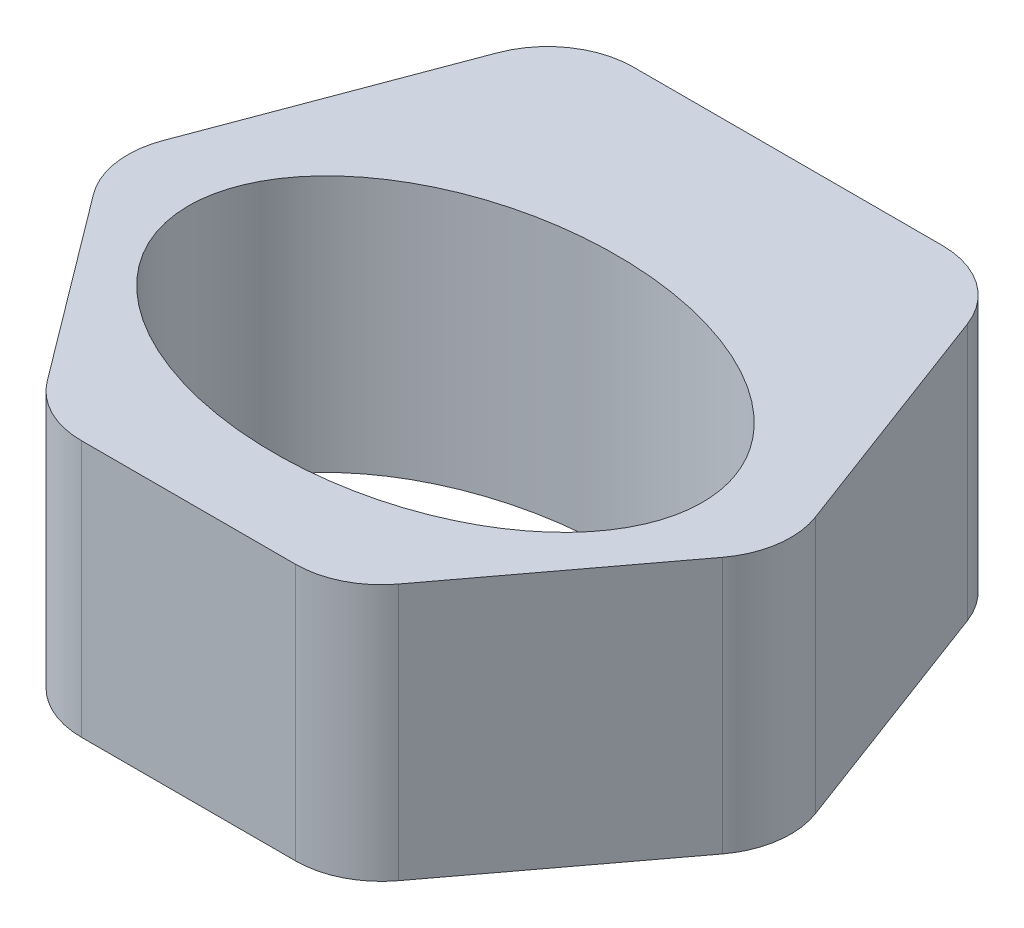
ISO-10303-21;
HEADER;
FILE_DESCRIPTION(('STEP AP214'),'2;1');
FILE_NAME('part.step','',(''),(''),'','','');
FILE_SCHEMA(('AUTOMOTIVE_DESIGN { 1 0 10303 214 1 1 1 1 }'));
ENDSEC;
DATA;
#1=APPLICATION_CONTEXT('core data for automotive mechanical design processes');
#2=APPLICATION_PROTOCOL_DEFINITION('international standard','automotive_design',2000,#1);
#3=PRODUCT_CONTEXT('',#1,'mechanical');
#4=PRODUCT('Part','Part','',(#3));
#5=PRODUCT_RELATED_PRODUCT_CATEGORY('part','',(#4));
#6=PRODUCT_DEFINITION_FORMATION('','',#4);
#7=PRODUCT_DEFINITION_CONTEXT('part definition',#1,'design');
#8=PRODUCT_DEFINITION('design','',#6,#7);
#9=PRODUCT_DEFINITION_SHAPE('','',#8);
#10=(LENGTH_UNIT() NAMED_UNIT(*) SI_UNIT(.MILLI.,.METRE.));
#11=(NAMED_UNIT(*) PLANE_ANGLE_UNIT() SI_UNIT($,.RADIAN.));
#12=(NAMED_UNIT(*) SI_UNIT($,.STERADIAN.) SOLID_ANGLE_UNIT());
#13=UNCERTAINTY_MEASURE_WITH_UNIT(LENGTH_MEASURE(1.E-05),#10,'distance_accuracy_value','');
#14=(GEOMETRIC_REPRESENTATION_CONTEXT(3) GLOBAL_UNCERTAINTY_ASSIGNED_CONTEXT((#13)) GLOBAL_UNIT_ASSIGNED_CONTEXT((#10,
#11,#12)) REPRESENTATION_CONTEXT('',''));
#15=CARTESIAN_POINT('',(0.,0.,0.));
#16=DIRECTION('',(0.,0.,1.));
#17=DIRECTION('',(1.,0.,0.));
#18=AXIS2_PLACEMENT_3D('',#15,#16,#17);
#19=CARTESIAN_POINT('',(0.,30.,0.));
#20=DIRECTION('',(0.,1.,0.));
#21=DIRECTION('',(0.,0.,1.));
#22=AXIS2_PLACEMENT_3D('',#19,#20,#21);
#23=PLANE('',#22);
#24=DIRECTION('',(-1.,0.,0.));
#25=VECTOR('',#24,1.);
#26=CARTESIAN_POINT('',(25.,30.,-40.));
#27=LINE('',#26,#25);
#28=CARTESIAN_POINT('',(18.0699953183531,30.,-40.));
#29=VERTEX_POINT('',#28);
#30=CARTESIAN_POINT('',(-18.0699953183531,30.,-40.));
#31=VERTEX_POINT('',#30);
#32=EDGE_CURVE('E164',#29,#31,#27,.T.);
#33=ORIENTED_EDGE('',*,*,#32,.T.);
#34=CARTESIAN_POINT('',(-18.0699953183531,30.,-30.));
#35=DIRECTION('',(0.,1.,0.));
#36=DIRECTION('',(0.,0.,1.));
#37=AXIS2_PLACEMENT_3D('',#34,#35,#36);
#38=CIRCLE('',#37,10.);
#39=CARTESIAN_POINT('',(-27.4332870940435,30.,-33.5112344158839));
#40=VERTEX_POINT('',#39);
#41=EDGE_CURVE('E196',#31,#40,#38,.T.);
#42=ORIENTED_EDGE('',*,*,#41,.T.);
#43=DIRECTION('',(-0.351123441588391,0.,0.936329177569045));
#44=VECTOR('',#43,1.);
#45=CARTESIAN_POINT('',(-25.,30.,-40.));
#46=LINE('',#45,#44);
#47=CARTESIAN_POINT('',(-38.0766219879258,30.,-5.12900803219777));
#48=VERTEX_POINT('',#47);
#49=EDGE_CURVE('E146',#40,#48,#46,.T.);
#50=ORIENTED_EDGE('',*,*,#49,.T.);
#51=CARTESIAN_POINT('',(-28.7133302122354,30.,-1.61777361631385));
#52=DIRECTION('',(0.,1.,0.));
#53=DIRECTION('',(0.,0.,1.));
#54=AXIS2_PLACEMENT_3D('',#51,#52,#53);
#55=CIRCLE('',#54,10.);
#56=CARTESIAN_POINT('',(-36.7133302122354,30.,4.38222638368614));
#57=VERTEX_POINT('',#56);
#58=EDGE_CURVE('E192',#48,#57,#55,.T.);
#59=ORIENTED_EDGE('',*,*,#58,.T.);
#60=DIRECTION('',(0.6,0.,0.8));
#61=VECTOR('',#60,1.);
#62=CARTESIAN_POINT('',(-40.,30.,0.));
#63=LINE('',#62,#61);
#64=CARTESIAN_POINT('',(-20.5,30.,26.));
#65=VERTEX_POINT('',#64);
#66=EDGE_CURVE('E238',#57,#65,#63,.T.);
#67=ORIENTED_EDGE('',*,*,#66,.T.);
#68=CARTESIAN_POINT('',(-12.5,30.,20.));
#69=DIRECTION('',(0.,1.,0.));
#70=DIRECTION('',(0.,0.,1.));
#71=AXIS2_PLACEMENT_3D('',#68,#69,#70);
#72=CIRCLE('',#71,10.);
#73=CARTESIAN_POINT('',(-12.5,30.,30.));
#74=VERTEX_POINT('',#73);
#75=EDGE_CURVE('E190',#65,#74,#72,.T.);
#76=ORIENTED_EDGE('',*,*,#75,.T.);
#77=DIRECTION('',(1.,0.,0.));
#78=VECTOR('',#77,1.);
#79=CARTESIAN_POINT('',(-17.5,30.,30.));
#80=LINE('',#79,#78);
#81=CARTESIAN_POINT('',(12.5,30.,30.));
#82=VERTEX_POINT('',#81);
#83=EDGE_CURVE('E224',#74,#82,#80,.T.);
#84=ORIENTED_EDGE('',*,*,#83,.T.);
#85=CARTESIAN_POINT('',(12.5,30.,20.));
#86=DIRECTION('',(0.,1.,0.));
#87=DIRECTION('',(0.,0.,1.));
#88=AXIS2_PLACEMENT_3D('',#85,#86,#87);
#89=CIRCLE('',#88,10.);
#90=CARTESIAN_POINT('',(20.5,30.,26.));
#91=VERTEX_POINT('',#90);
#92=EDGE_CURVE('E188',#82,#91,#89,.T.);
#93=ORIENTED_EDGE('',*,*,#92,.T.);
#94=DIRECTION('',(0.6,0.,-0.8));
#95=VECTOR('',#94,1.);
#96=CARTESIAN_POINT('',(40.,30.,0.));
#97=LINE('',#96,#95);
#98=CARTESIAN_POINT('',(36.7133302122354,30.,4.38222638368616));
#99=VERTEX_POINT('',#98);
#100=EDGE_CURVE('E215',#91,#99,#97,.T.);
#101=ORIENTED_EDGE('',*,*,#100,.T.);
#102=CARTESIAN_POINT('',(28.7133302122354,30.,-1.61777361631384));
#103=DIRECTION('',(0.,1.,0.));
#104=DIRECTION('',(0.,0.,1.));
#105=AXIS2_PLACEMENT_3D('',#102,#103,#104);
#106=CIRCLE('',#105,10.);
#107=CARTESIAN_POINT('',(38.0766219879258,30.,-5.12900803219775));
#108=VERTEX_POINT('',#107);
#109=EDGE_CURVE('E57',#99,#108,#106,.T.);
#110=ORIENTED_EDGE('',*,*,#109,.T.);
#111=DIRECTION('',(-0.351123441588391,0.,-0.936329177569045));
#112=VECTOR('',#111,1.);
#113=CARTESIAN_POINT('',(25.,30.,-40.));
#114=LINE('',#113,#112);
#115=CARTESIAN_POINT('',(27.4332870940435,30.,-33.5112344158839));
#116=VERTEX_POINT('',#115);
#117=EDGE_CURVE('E223',#108,#116,#114,.T.);
#118=ORIENTED_EDGE('',*,*,#117,.T.);
#119=CARTESIAN_POINT('',(18.0699953183531,30.,-30.));
#120=DIRECTION('',(0.,1.,0.));
#121=DIRECTION('',(0.,0.,1.));
#122=AXIS2_PLACEMENT_3D('',#119,#120,#121);
#123=CIRCLE('',#122,10.);
#124=EDGE_CURVE('E194',#116,#29,#123,.T.);
#125=ORIENTED_EDGE('',*,*,#124,.T.);
#126=EDGE_LOOP('',(#33,#42,#50,#59,#67,#76,#84,#93,#101,#110,#118,#125));
#127=FACE_BOUND('',#126,.T.);
#128=CARTESIAN_POINT('',(0.,30.,0.));
#129=DIRECTION('',(0.,1.,0.));
#130=DIRECTION('',(-1.,0.,0.));
#131=AXIS2_PLACEMENT_3D('',#128,#129,#130);
#132=ELLIPSE('',#131,30.,20.);
#133=CARTESIAN_POINT('',(-30.,30.,0.));
#134=VERTEX_POINT('',#133);
#135=EDGE_CURVE('E155',#134,#134,#132,.T.);
#136=ORIENTED_EDGE('',*,*,#135,.F.);
#137=EDGE_LOOP('',(#136));
#138=FACE_BOUND('',#137,.T.);
#139=ADVANCED_FACE('F35',(#127,#138),#23,.T.);
#140=CARTESIAN_POINT('',(0.,0.,0.));
#141=DIRECTION('',(0.,1.,0.));
#142=DIRECTION('',(0.,0.,1.));
#143=AXIS2_PLACEMENT_3D('',#140,#141,#142);
#144=PLANE('',#143);
#145=DIRECTION('',(-0.351123441588391,0.,0.936329177569045));
#146=VECTOR('',#145,1.);
#147=CARTESIAN_POINT('',(-25.,0.,-40.));
#148=LINE('',#147,#146);
#149=CARTESIAN_POINT('',(-27.4332870940435,0.,-33.5112344158839));
#150=VERTEX_POINT('',#149);
#151=CARTESIAN_POINT('',(-38.0766219879258,0.,-5.12900803219777));
#152=VERTEX_POINT('',#151);
#153=EDGE_CURVE('E143',#150,#152,#148,.T.);
#154=ORIENTED_EDGE('',*,*,#153,.F.);
#155=CARTESIAN_POINT('',(-18.0699953183531,0.,-30.));
#156=DIRECTION('',(0.,1.,0.));
#157=DIRECTION('',(0.,0.,1.));
#158=AXIS2_PLACEMENT_3D('',#155,#156,#157);
#159=CIRCLE('',#158,10.);
#160=CARTESIAN_POINT('',(-18.0699953183531,0.,-40.));
#161=VERTEX_POINT('',#160);
#162=EDGE_CURVE('E126',#150,#161,#159,.F.);
#163=ORIENTED_EDGE('',*,*,#162,.T.);
#164=DIRECTION('',(-1.,0.,0.));
#165=VECTOR('',#164,1.);
#166=CARTESIAN_POINT('',(25.,0.,-40.));
#167=LINE('',#166,#165);
#168=CARTESIAN_POINT('',(18.0699953183531,0.,-40.));
#169=VERTEX_POINT('',#168);
#170=EDGE_CURVE('E174',#169,#161,#167,.T.);
#171=ORIENTED_EDGE('',*,*,#170,.F.);
#172=CARTESIAN_POINT('',(18.0699953183531,0.,-30.));
#173=DIRECTION('',(0.,1.,0.));
#174=DIRECTION('',(0.,0.,1.));
#175=AXIS2_PLACEMENT_3D('',#172,#173,#174);
#176=CIRCLE('',#175,10.);
#177=CARTESIAN_POINT('',(27.4332870940435,0.,-33.5112344158839));
#178=VERTEX_POINT('',#177);
#179=EDGE_CURVE('E137',#169,#178,#176,.F.);
#180=ORIENTED_EDGE('',*,*,#179,.T.);
#181=DIRECTION('',(-0.351123441588391,0.,-0.936329177569045));
#182=VECTOR('',#181,1.);
#183=CARTESIAN_POINT('',(25.,0.,-40.));
#184=LINE('',#183,#182);
#185=CARTESIAN_POINT('',(38.0766219879258,0.,-5.12900803219775));
#186=VERTEX_POINT('',#185);
#187=EDGE_CURVE('E172',#186,#178,#184,.T.);
#188=ORIENTED_EDGE('',*,*,#187,.F.);
#189=CARTESIAN_POINT('',(28.7133302122354,0.,-1.61777361631384));
#190=DIRECTION('',(0.,1.,0.));
#191=DIRECTION('',(0.,0.,1.));
#192=AXIS2_PLACEMENT_3D('',#189,#190,#191);
#193=CIRCLE('',#192,10.);
#194=CARTESIAN_POINT('',(36.7133302122354,0.,4.38222638368616));
#195=VERTEX_POINT('',#194);
#196=EDGE_CURVE('E147',#186,#195,#193,.F.);
#197=ORIENTED_EDGE('',*,*,#196,.T.);
#198=DIRECTION('',(0.6,0.,-0.8));
#199=VECTOR('',#198,1.);
#200=CARTESIAN_POINT('',(40.,0.,0.));
#201=LINE('',#200,#199);
#202=CARTESIAN_POINT('',(20.5,0.,26.));
#203=VERTEX_POINT('',#202);
#204=EDGE_CURVE('E169',#203,#195,#201,.T.);
#205=ORIENTED_EDGE('',*,*,#204,.F.);
#206=CARTESIAN_POINT('',(12.5,0.,20.));
#207=DIRECTION('',(0.,1.,0.));
#208=DIRECTION('',(0.,0.,1.));
#209=AXIS2_PLACEMENT_3D('',#206,#207,#208);
#210=CIRCLE('',#209,10.);
#211=CARTESIAN_POINT('',(12.5,0.,30.));
#212=VERTEX_POINT('',#211);
#213=EDGE_CURVE('E178',#203,#212,#210,.F.);
#214=ORIENTED_EDGE('',*,*,#213,.T.);
#215=DIRECTION('',(1.,0.,0.));
#216=VECTOR('',#215,1.);
#217=CARTESIAN_POINT('',(-17.5,0.,30.));
#218=LINE('',#217,#216);
#219=CARTESIAN_POINT('',(-12.5,0.,30.));
#220=VERTEX_POINT('',#219);
#221=EDGE_CURVE('E158',#220,#212,#218,.T.);
#222=ORIENTED_EDGE('',*,*,#221,.F.);
#223=CARTESIAN_POINT('',(-12.5,0.,20.));
#224=DIRECTION('',(0.,1.,0.));
#225=DIRECTION('',(0.,0.,1.));
#226=AXIS2_PLACEMENT_3D('',#223,#224,#225);
#227=CIRCLE('',#226,10.);
#228=CARTESIAN_POINT('',(-20.5,0.,26.));
#229=VERTEX_POINT('',#228);
#230=EDGE_CURVE('E180',#220,#229,#227,.F.);
#231=ORIENTED_EDGE('',*,*,#230,.T.);
#232=DIRECTION('',(0.6,0.,0.8));
#233=VECTOR('',#232,1.);
#234=CARTESIAN_POINT('',(-40.,0.,0.));
#235=LINE('',#234,#233);
#236=CARTESIAN_POINT('',(-36.7133302122354,0.,4.38222638368614));
#237=VERTEX_POINT('',#236);
#238=EDGE_CURVE('E154',#237,#229,#235,.T.);
#239=ORIENTED_EDGE('',*,*,#238,.F.);
#240=CARTESIAN_POINT('',(-28.7133302122354,0.,-1.61777361631385));
#241=DIRECTION('',(0.,1.,0.));
#242=DIRECTION('',(0.,0.,1.));
#243=AXIS2_PLACEMENT_3D('',#240,#241,#242);
#244=CIRCLE('',#243,10.);
#245=EDGE_CURVE('E153',#237,#152,#244,.F.);
#246=ORIENTED_EDGE('',*,*,#245,.T.);
#247=EDGE_LOOP('',(#154,#163,#171,#180,#188,#197,#205,#214,#222,#231,#239,#246));
#248=FACE_BOUND('',#247,.T.);
#249=CARTESIAN_POINT('',(0.,0.,0.));
#250=DIRECTION('',(0.,1.,0.));
#251=DIRECTION('',(-1.,0.,0.));
#252=AXIS2_PLACEMENT_3D('',#249,#250,#251);
#253=ELLIPSE('',#252,30.,20.);
#254=CARTESIAN_POINT('',(-30.,0.,0.));
#255=VERTEX_POINT('',#254);
#256=EDGE_CURVE('E161',#255,#255,#253,.T.);
#257=ORIENTED_EDGE('',*,*,#256,.T.);
#258=EDGE_LOOP('',(#257));
#259=FACE_BOUND('',#258,.T.);
#260=ADVANCED_FACE('F150',(#248,#259),#144,.F.);
#261=CARTESIAN_POINT('',(-25.,30.,-40.));
#262=DIRECTION('',(0.936329177569045,0.,0.351123441588392));
#263=DIRECTION('',(0.351123441588392,0.,-0.936329177569045));
#264=AXIS2_PLACEMENT_3D('',#261,#262,#263);
#265=PLANE('',#264);
#266=ORIENTED_EDGE('',*,*,#49,.F.);
#267=DIRECTION('',(0.,-1.,0.));
#268=VECTOR('',#267,1.);
#269=CARTESIAN_POINT('',(-27.4332870940435,30.,-33.5112344158839));
#270=LINE('',#269,#268);
#271=EDGE_CURVE('E130',#40,#150,#270,.T.);
#272=ORIENTED_EDGE('',*,*,#271,.T.);
#273=ORIENTED_EDGE('',*,*,#153,.T.);
#274=DIRECTION('',(0.,-1.,0.));
#275=VECTOR('',#274,1.);
#276=CARTESIAN_POINT('',(-38.0766219879258,30.,-5.12900803219778));
#277=LINE('',#276,#275);
#278=EDGE_CURVE('E148',#152,#48,#277,.F.);
#279=ORIENTED_EDGE('',*,*,#278,.T.);
#280=EDGE_LOOP('',(#266,#272,#273,#279));
#281=FACE_BOUND('',#280,.T.);
#282=ADVANCED_FACE('F142',(#281),#265,.F.);
#283=CARTESIAN_POINT('',(-40.,30.,0.));
#284=DIRECTION('',(0.8,0.,-0.6));
#285=DIRECTION('',(-0.6,0.,-0.8));
#286=AXIS2_PLACEMENT_3D('',#283,#284,#285);
#287=PLANE('',#286);
#288=ORIENTED_EDGE('',*,*,#66,.F.);
#289=DIRECTION('',(0.,-1.,0.));
#290=VECTOR('',#289,1.);
#291=CARTESIAN_POINT('',(-36.7133302122354,30.,4.38222638368614));
#292=LINE('',#291,#290);
#293=EDGE_CURVE('E204',#57,#237,#292,.T.);
#294=ORIENTED_EDGE('',*,*,#293,.T.);
#295=ORIENTED_EDGE('',*,*,#238,.T.);
#296=DIRECTION('',(0.,-1.,0.));
#297=VECTOR('',#296,1.);
#298=CARTESIAN_POINT('',(-20.5,30.,26.));
#299=LINE('',#298,#297);
#300=EDGE_CURVE('E202',#229,#65,#299,.F.);
#301=ORIENTED_EDGE('',*,*,#300,.T.);
#302=EDGE_LOOP('',(#288,#294,#295,#301));
#303=FACE_BOUND('',#302,.T.);
#304=ADVANCED_FACE('F262',(#303),#287,.F.);
#305=CARTESIAN_POINT('',(-17.5,30.,30.));
#306=DIRECTION('',(0.,0.,-1.));
#307=DIRECTION('',(-1.,0.,0.));
#308=AXIS2_PLACEMENT_3D('',#305,#306,#307);
#309=PLANE('',#308);
#310=ORIENTED_EDGE('',*,*,#83,.F.);
#311=DIRECTION('',(0.,-1.,0.));
#312=VECTOR('',#311,1.);
#313=CARTESIAN_POINT('',(-12.5,30.,30.));
#314=LINE('',#313,#312);
#315=EDGE_CURVE('E209',#74,#220,#314,.T.);
#316=ORIENTED_EDGE('',*,*,#315,.T.);
#317=ORIENTED_EDGE('',*,*,#221,.T.);
#318=DIRECTION('',(0.,-1.,0.));
#319=VECTOR('',#318,1.);
#320=CARTESIAN_POINT('',(12.5,30.,30.));
#321=LINE('',#320,#319);
#322=EDGE_CURVE('E207',#212,#82,#321,.F.);
#323=ORIENTED_EDGE('',*,*,#322,.T.);
#324=EDGE_LOOP('',(#310,#316,#317,#323));
#325=FACE_BOUND('',#324,.T.);
#326=ADVANCED_FACE('F259',(#325),#309,.F.);
#327=CARTESIAN_POINT('',(40.,30.,0.));
#328=DIRECTION('',(-0.8,0.,-0.6));
#329=DIRECTION('',(-0.6,0.,0.8));
#330=AXIS2_PLACEMENT_3D('',#327,#328,#329);
#331=PLANE('',#330);
#332=ORIENTED_EDGE('',*,*,#100,.F.);
#333=DIRECTION('',(0.,-1.,0.));
#334=VECTOR('',#333,1.);
#335=CARTESIAN_POINT('',(20.5,30.,26.));
#336=LINE('',#335,#334);
#337=EDGE_CURVE('E11',#91,#203,#336,.T.);
#338=ORIENTED_EDGE('',*,*,#337,.T.);
#339=ORIENTED_EDGE('',*,*,#204,.T.);
#340=DIRECTION('',(0.,-1.,0.));
#341=VECTOR('',#340,1.);
#342=CARTESIAN_POINT('',(36.7133302122354,30.,4.38222638368616));
#343=LINE('',#342,#341);
#344=EDGE_CURVE('E43',#195,#99,#343,.F.);
#345=ORIENTED_EDGE('',*,*,#344,.T.);
#346=EDGE_LOOP('',(#332,#338,#339,#345));
#347=FACE_BOUND('',#346,.T.);
#348=ADVANCED_FACE('F214',(#347),#331,.F.);
#349=CARTESIAN_POINT('',(25.,30.,-40.));
#350=DIRECTION('',(-0.936329177569045,0.,0.351123441588391));
#351=DIRECTION('',(0.351123441588392,0.,0.936329177569045));
#352=AXIS2_PLACEMENT_3D('',#349,#350,#351);
#353=PLANE('',#352);
#354=ORIENTED_EDGE('',*,*,#187,.T.);
#355=DIRECTION('',(0.,-1.,0.));
#356=VECTOR('',#355,1.);
#357=CARTESIAN_POINT('',(27.4332870940435,30.,-33.5112344158839));
#358=LINE('',#357,#356);
#359=EDGE_CURVE('E50',#178,#116,#358,.F.);
#360=ORIENTED_EDGE('',*,*,#359,.T.);
#361=ORIENTED_EDGE('',*,*,#117,.F.);
#362=DIRECTION('',(0.,-1.,0.));
#363=VECTOR('',#362,1.);
#364=CARTESIAN_POINT('',(38.0766219879258,30.,-5.12900803219775));
#365=LINE('',#364,#363);
#366=EDGE_CURVE('E198',#108,#186,#365,.T.);
#367=ORIENTED_EDGE('',*,*,#366,.T.);
#368=EDGE_LOOP('',(#354,#360,#361,#367));
#369=FACE_BOUND('',#368,.T.);
#370=ADVANCED_FACE('F228',(#369),#353,.F.);
#371=CARTESIAN_POINT('',(25.,30.,-40.));
#372=DIRECTION('',(0.,0.,1.));
#373=DIRECTION('',(1.,0.,0.));
#374=AXIS2_PLACEMENT_3D('',#371,#372,#373);
#375=PLANE('',#374);
#376=ORIENTED_EDGE('',*,*,#170,.T.);
#377=DIRECTION('',(0.,-1.,0.));
#378=VECTOR('',#377,1.);
#379=CARTESIAN_POINT('',(-18.0699953183531,30.,-40.));
#380=LINE('',#379,#378);
#381=EDGE_CURVE('E131',#161,#31,#380,.F.);
#382=ORIENTED_EDGE('',*,*,#381,.T.);
#383=ORIENTED_EDGE('',*,*,#32,.F.);
#384=DIRECTION('',(0.,-1.,0.));
#385=VECTOR('',#384,1.);
#386=CARTESIAN_POINT('',(18.0699953183531,30.,-40.));
#387=LINE('',#386,#385);
#388=EDGE_CURVE('E136',#29,#169,#387,.T.);
#389=ORIENTED_EDGE('',*,*,#388,.T.);
#390=EDGE_LOOP('',(#376,#382,#383,#389));
#391=FACE_BOUND('',#390,.T.);
#392=ADVANCED_FACE('F235',(#391),#375,.F.);
#393=DIRECTION('',(0.,-1.,0.));
#394=VECTOR('',#393,1.);
#395=SURFACE_OF_LINEAR_EXTRUSION('',#132,#394);
#396=ORIENTED_EDGE('',*,*,#135,.T.);
#397=EDGE_LOOP('',(#396));
#398=FACE_BOUND('',#397,.T.);
#399=ORIENTED_EDGE('',*,*,#256,.F.);
#400=EDGE_LOOP('',(#399));
#401=FACE_BOUND('',#400,.T.);
#402=ADVANCED_FACE('F245',(#398,#401),#395,.T.);
#403=CARTESIAN_POINT('',(-18.0699953183531,30.,-30.));
#404=DIRECTION('',(0.,-1.,0.));
#405=DIRECTION('',(0.,0.,-1.));
#406=AXIS2_PLACEMENT_3D('',#403,#404,#405);
#407=CYLINDRICAL_SURFACE('',#406,10.);
#408=ORIENTED_EDGE('',*,*,#41,.F.);
#409=ORIENTED_EDGE('',*,*,#381,.F.);
#410=ORIENTED_EDGE('',*,*,#162,.F.);
#411=ORIENTED_EDGE('',*,*,#271,.F.);
#412=EDGE_LOOP('',(#408,#409,#410,#411));
#413=FACE_BOUND('',#412,.T.);
#414=ADVANCED_FACE('F129',(#413),#407,.T.);
#415=CARTESIAN_POINT('',(18.0699953183531,30.,-30.));
#416=DIRECTION('',(0.,-1.,0.));
#417=DIRECTION('',(0.,0.,-1.));
#418=AXIS2_PLACEMENT_3D('',#415,#416,#417);
#419=CYLINDRICAL_SURFACE('',#418,10.);
#420=ORIENTED_EDGE('',*,*,#124,.F.);
#421=ORIENTED_EDGE('',*,*,#359,.F.);
#422=ORIENTED_EDGE('',*,*,#179,.F.);
#423=ORIENTED_EDGE('',*,*,#388,.F.);
#424=EDGE_LOOP('',(#420,#421,#422,#423));
#425=FACE_BOUND('',#424,.T.);
#426=ADVANCED_FACE('F232',(#425),#419,.T.);
#427=CARTESIAN_POINT('',(-28.7133302122354,30.,-1.61777361631385));
#428=DIRECTION('',(0.,-1.,0.));
#429=DIRECTION('',(0.,0.,-1.));
#430=AXIS2_PLACEMENT_3D('',#427,#428,#429);
#431=CYLINDRICAL_SURFACE('',#430,10.);
#432=ORIENTED_EDGE('',*,*,#58,.F.);
#433=ORIENTED_EDGE('',*,*,#278,.F.);
#434=ORIENTED_EDGE('',*,*,#245,.F.);
#435=ORIENTED_EDGE('',*,*,#293,.F.);
#436=EDGE_LOOP('',(#432,#433,#434,#435));
#437=FACE_BOUND('',#436,.T.);
#438=ADVANCED_FACE('F273',(#437),#431,.T.);
#439=CARTESIAN_POINT('',(-12.5,30.,20.));
#440=DIRECTION('',(0.,-1.,0.));
#441=DIRECTION('',(0.,0.,-1.));
#442=AXIS2_PLACEMENT_3D('',#439,#440,#441);
#443=CYLINDRICAL_SURFACE('',#442,10.);
#444=ORIENTED_EDGE('',*,*,#75,.F.);
#445=ORIENTED_EDGE('',*,*,#300,.F.);
#446=ORIENTED_EDGE('',*,*,#230,.F.);
#447=ORIENTED_EDGE('',*,*,#315,.F.);
#448=EDGE_LOOP('',(#444,#445,#446,#447));
#449=FACE_BOUND('',#448,.T.);
#450=ADVANCED_FACE('F276',(#449),#443,.T.);
#451=CARTESIAN_POINT('',(12.5,30.,20.));
#452=DIRECTION('',(0.,-1.,0.));
#453=DIRECTION('',(0.,0.,-1.));
#454=AXIS2_PLACEMENT_3D('',#451,#452,#453);
#455=CYLINDRICAL_SURFACE('',#454,10.);
#456=ORIENTED_EDGE('',*,*,#92,.F.);
#457=ORIENTED_EDGE('',*,*,#322,.F.);
#458=ORIENTED_EDGE('',*,*,#213,.F.);
#459=ORIENTED_EDGE('',*,*,#337,.F.);
#460=EDGE_LOOP('',(#456,#457,#458,#459));
#461=FACE_BOUND('',#460,.T.);
#462=ADVANCED_FACE('F279',(#461),#455,.T.);
#463=CARTESIAN_POINT('',(28.7133302122354,30.,-1.61777361631384));
#464=DIRECTION('',(0.,-1.,0.));
#465=DIRECTION('',(0.,0.,-1.));
#466=AXIS2_PLACEMENT_3D('',#463,#464,#465);
#467=CYLINDRICAL_SURFACE('',#466,10.);
#468=ORIENTED_EDGE('',*,*,#109,.F.);
#469=ORIENTED_EDGE('',*,*,#344,.F.);
#470=ORIENTED_EDGE('',*,*,#196,.F.);
#471=ORIENTED_EDGE('',*,*,#366,.F.);
#472=EDGE_LOOP('',(#468,#469,#470,#471));
#473=FACE_BOUND('',#472,.T.);
#474=ADVANCED_FACE('F37',(#473),#467,.T.);
#475=CLOSED_SHELL('',(#139,#260,#282,#304,#326,#348,#370,#392,#402,#414,#426,#438,#450,#462,#474));
#476=MANIFOLD_SOLID_BREP('B2',#475);
#477=ADVANCED_BREP_SHAPE_REPRESENTATION('',(#18,#476),#14);
#478=SHAPE_DEFINITION_REPRESENTATION(#9,#477);
ENDSEC;
END-ISO-10303-21;
